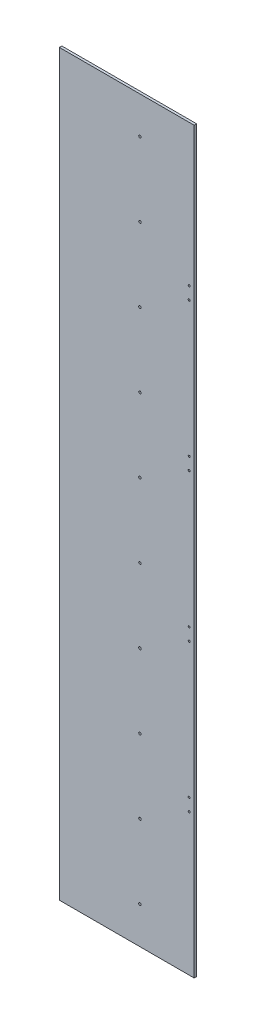
ISO-10303-21;
HEADER;
FILE_DESCRIPTION(('STEP AP214'),'2;1');
FILE_NAME('part.step','',(''),(''),'','','');
FILE_SCHEMA(('AUTOMOTIVE_DESIGN { 1 0 10303 214 1 1 1 1 }'));
ENDSEC;
DATA;
#1=APPLICATION_CONTEXT('core data for automotive mechanical design processes');
#2=APPLICATION_PROTOCOL_DEFINITION('international standard','automotive_design',2000,#1);
#3=PRODUCT_CONTEXT('',#1,'mechanical');
#4=PRODUCT('Part','Part','',(#3));
#5=PRODUCT_RELATED_PRODUCT_CATEGORY('part','',(#4));
#6=PRODUCT_DEFINITION_FORMATION('','',#4);
#7=PRODUCT_DEFINITION_CONTEXT('part definition',#1,'design');
#8=PRODUCT_DEFINITION('design','',#6,#7);
#9=PRODUCT_DEFINITION_SHAPE('','',#8);
#10=(LENGTH_UNIT() NAMED_UNIT(*) SI_UNIT(.MILLI.,.METRE.));
#11=(NAMED_UNIT(*) PLANE_ANGLE_UNIT() SI_UNIT($,.RADIAN.));
#12=(NAMED_UNIT(*) SI_UNIT($,.STERADIAN.) SOLID_ANGLE_UNIT());
#13=UNCERTAINTY_MEASURE_WITH_UNIT(LENGTH_MEASURE(1.E-05),#10,'distance_accuracy_value','');
#14=(GEOMETRIC_REPRESENTATION_CONTEXT(3) GLOBAL_UNCERTAINTY_ASSIGNED_CONTEXT((#13)) GLOBAL_UNIT_ASSIGNED_CONTEXT((#10,
#11,#12)) REPRESENTATION_CONTEXT('',''));
#15=CARTESIAN_POINT('',(0.,0.,0.));
#16=DIRECTION('',(0.,0.,1.));
#17=DIRECTION('',(1.,0.,0.));
#18=AXIS2_PLACEMENT_3D('',#15,#16,#17);
#19=CARTESIAN_POINT('',(75.,0.,-35.));
#20=DIRECTION('',(0.,1.,0.));
#21=DIRECTION('',(-1.,0.,0.));
#22=AXIS2_PLACEMENT_3D('',#19,#20,#21);
#23=PLANE('',#22);
#24=DIRECTION('',(-1.,0.,0.));
#25=VECTOR('',#24,1.);
#26=CARTESIAN_POINT('',(75.,0.,-35.));
#27=LINE('',#26,#25);
#28=CARTESIAN_POINT('',(136.780972450962,0.,-35.));
#29=VERTEX_POINT('',#28);
#30=CARTESIAN_POINT('',(-136.780972450962,0.,-35.));
#31=VERTEX_POINT('',#30);
#32=EDGE_CURVE('E58',#29,#31,#27,.T.);
#33=ORIENTED_EDGE('',*,*,#32,.F.);
#34=DIRECTION('',(0.,0.,-1.));
#35=VECTOR('',#34,1.);
#36=CARTESIAN_POINT('',(136.780972450962,0.,-35.));
#37=LINE('',#36,#35);
#38=CARTESIAN_POINT('',(136.780972450962,0.,-30.));
#39=VERTEX_POINT('',#38);
#40=EDGE_CURVE('E96',#39,#29,#37,.T.);
#41=ORIENTED_EDGE('',*,*,#40,.F.);
#42=DIRECTION('',(1.,0.,0.));
#43=VECTOR('',#42,1.);
#44=CARTESIAN_POINT('',(75.,0.,-30.));
#45=LINE('',#44,#43);
#46=CARTESIAN_POINT('',(-136.780972450962,0.,-30.));
#47=VERTEX_POINT('',#46);
#48=EDGE_CURVE('E67',#39,#47,#45,.F.);
#49=ORIENTED_EDGE('',*,*,#48,.T.);
#50=DIRECTION('',(0.,0.,-1.));
#51=VECTOR('',#50,1.);
#52=CARTESIAN_POINT('',(-136.780972450962,0.,-35.));
#53=LINE('',#52,#51);
#54=EDGE_CURVE('E94',#47,#31,#53,.T.);
#55=ORIENTED_EDGE('',*,*,#54,.T.);
#56=EDGE_LOOP('',(#33,#41,#49,#55));
#57=FACE_BOUND('',#56,.T.);
#58=ADVANCED_FACE('F47',(#57),#23,.F.);
#59=CARTESIAN_POINT('',(75.,1500.,-35.));
#60=DIRECTION('',(0.,1.,0.));
#61=DIRECTION('',(-1.,0.,0.));
#62=AXIS2_PLACEMENT_3D('',#59,#60,#61);
#63=PLANE('',#62);
#64=DIRECTION('',(-1.,0.,0.));
#65=VECTOR('',#64,1.);
#66=CARTESIAN_POINT('',(75.,1500.,-35.));
#67=LINE('',#66,#65);
#68=CARTESIAN_POINT('',(136.780972450962,1500.,-35.));
#69=VERTEX_POINT('',#68);
#70=CARTESIAN_POINT('',(-136.780972450962,1500.,-35.));
#71=VERTEX_POINT('',#70);
#72=EDGE_CURVE('E12',#69,#71,#67,.T.);
#73=ORIENTED_EDGE('',*,*,#72,.T.);
#74=DIRECTION('',(0.,0.,-1.));
#75=VECTOR('',#74,1.);
#76=CARTESIAN_POINT('',(-136.780972450962,1500.,-35.));
#77=LINE('',#76,#75);
#78=CARTESIAN_POINT('',(-136.780972450962,1500.,-30.));
#79=VERTEX_POINT('',#78);
#80=EDGE_CURVE('E118',#79,#71,#77,.T.);
#81=ORIENTED_EDGE('',*,*,#80,.F.);
#82=DIRECTION('',(1.,0.,0.));
#83=VECTOR('',#82,1.);
#84=CARTESIAN_POINT('',(75.,1500.,-30.));
#85=LINE('',#84,#83);
#86=CARTESIAN_POINT('',(136.780972450962,1500.,-30.));
#87=VERTEX_POINT('',#86);
#88=EDGE_CURVE('E86',#87,#79,#85,.F.);
#89=ORIENTED_EDGE('',*,*,#88,.F.);
#90=DIRECTION('',(0.,0.,-1.));
#91=VECTOR('',#90,1.);
#92=CARTESIAN_POINT('',(136.780972450962,1500.,-35.));
#93=LINE('',#92,#91);
#94=EDGE_CURVE('E154',#87,#69,#93,.T.);
#95=ORIENTED_EDGE('',*,*,#94,.T.);
#96=EDGE_LOOP('',(#73,#81,#89,#95));
#97=FACE_BOUND('',#96,.T.);
#98=ADVANCED_FACE('F292',(#97),#63,.T.);
#99=CARTESIAN_POINT('',(26.7499999999954,75.0000000000002,-35.));
#100=DIRECTION('',(0.,0.,1.));
#101=DIRECTION('',(1.,0.,0.));
#102=AXIS2_PLACEMENT_3D('',#99,#100,#101);
#103=CYLINDRICAL_SURFACE('',#102,2.5);
#104=CARTESIAN_POINT('',(26.7499999999954,75.0000000000002,-35.));
#105=DIRECTION('',(0.,0.,-1.));
#106=DIRECTION('',(-1.,0.,0.));
#107=AXIS2_PLACEMENT_3D('',#104,#105,#106);
#108=CIRCLE('',#107,2.5);
#109=CARTESIAN_POINT('',(24.2499999999954,75.0000000000002,-35.));
#110=VERTEX_POINT('',#109);
#111=EDGE_CURVE('E195',#110,#110,#108,.T.);
#112=ORIENTED_EDGE('',*,*,#111,.T.);
#113=EDGE_LOOP('',(#112));
#114=FACE_BOUND('',#113,.T.);
#115=CARTESIAN_POINT('',(26.7499999999954,75.0000000000002,-30.));
#116=DIRECTION('',(0.,0.,-1.));
#117=DIRECTION('',(-1.,0.,0.));
#118=AXIS2_PLACEMENT_3D('',#115,#116,#117);
#119=CIRCLE('',#118,2.5);
#120=CARTESIAN_POINT('',(24.2499999999954,75.0000000000002,-30.));
#121=VERTEX_POINT('',#120);
#122=EDGE_CURVE('E125',#121,#121,#119,.T.);
#123=ORIENTED_EDGE('',*,*,#122,.F.);
#124=EDGE_LOOP('',(#123));
#125=FACE_BOUND('',#124,.T.);
#126=ADVANCED_FACE('F297',(#114,#125),#103,.F.);
#127=CARTESIAN_POINT('',(26.7499999999959,225.,-35.));
#128=DIRECTION('',(0.,0.,1.));
#129=DIRECTION('',(1.,0.,0.));
#130=AXIS2_PLACEMENT_3D('',#127,#128,#129);
#131=CYLINDRICAL_SURFACE('',#130,2.5);
#132=CARTESIAN_POINT('',(26.7499999999959,225.,-35.));
#133=DIRECTION('',(0.,0.,-1.));
#134=DIRECTION('',(-1.,0.,0.));
#135=AXIS2_PLACEMENT_3D('',#132,#133,#134);
#136=CIRCLE('',#135,2.5);
#137=CARTESIAN_POINT('',(24.2499999999959,225.,-35.));
#138=VERTEX_POINT('',#137);
#139=EDGE_CURVE('E199',#138,#138,#136,.T.);
#140=ORIENTED_EDGE('',*,*,#139,.T.);
#141=EDGE_LOOP('',(#140));
#142=FACE_BOUND('',#141,.T.);
#143=CARTESIAN_POINT('',(26.7499999999959,225.,-30.));
#144=DIRECTION('',(0.,0.,-1.));
#145=DIRECTION('',(-1.,0.,0.));
#146=AXIS2_PLACEMENT_3D('',#143,#144,#145);
#147=CIRCLE('',#146,2.5);
#148=CARTESIAN_POINT('',(24.2499999999959,225.,-30.));
#149=VERTEX_POINT('',#148);
#150=EDGE_CURVE('E242',#149,#149,#147,.T.);
#151=ORIENTED_EDGE('',*,*,#150,.F.);
#152=EDGE_LOOP('',(#151));
#153=FACE_BOUND('',#152,.T.);
#154=ADVANCED_FACE('F303',(#142,#153),#131,.F.);
#155=CARTESIAN_POINT('',(26.7499999999964,375.,-35.));
#156=DIRECTION('',(0.,0.,1.));
#157=DIRECTION('',(1.,0.,0.));
#158=AXIS2_PLACEMENT_3D('',#155,#156,#157);
#159=CYLINDRICAL_SURFACE('',#158,2.5);
#160=CARTESIAN_POINT('',(26.7499999999964,375.,-35.));
#161=DIRECTION('',(0.,0.,-1.));
#162=DIRECTION('',(-1.,0.,0.));
#163=AXIS2_PLACEMENT_3D('',#160,#161,#162);
#164=CIRCLE('',#163,2.5);
#165=CARTESIAN_POINT('',(24.2499999999964,375.,-35.));
#166=VERTEX_POINT('',#165);
#167=EDGE_CURVE('E203',#166,#166,#164,.T.);
#168=ORIENTED_EDGE('',*,*,#167,.T.);
#169=EDGE_LOOP('',(#168));
#170=FACE_BOUND('',#169,.T.);
#171=CARTESIAN_POINT('',(26.7499999999964,375.,-30.));
#172=DIRECTION('',(0.,0.,-1.));
#173=DIRECTION('',(-1.,0.,0.));
#174=AXIS2_PLACEMENT_3D('',#171,#172,#173);
#175=CIRCLE('',#174,2.5);
#176=CARTESIAN_POINT('',(24.2499999999964,375.,-30.));
#177=VERTEX_POINT('',#176);
#178=EDGE_CURVE('E246',#177,#177,#175,.T.);
#179=ORIENTED_EDGE('',*,*,#178,.F.);
#180=EDGE_LOOP('',(#179));
#181=FACE_BOUND('',#180,.T.);
#182=ADVANCED_FACE('F307',(#170,#181),#159,.F.);
#183=CARTESIAN_POINT('',(26.7499999999969,525.,-35.));
#184=DIRECTION('',(0.,0.,1.));
#185=DIRECTION('',(1.,0.,0.));
#186=AXIS2_PLACEMENT_3D('',#183,#184,#185);
#187=CYLINDRICAL_SURFACE('',#186,2.5);
#188=CARTESIAN_POINT('',(26.7499999999969,525.,-35.));
#189=DIRECTION('',(0.,0.,-1.));
#190=DIRECTION('',(-1.,0.,0.));
#191=AXIS2_PLACEMENT_3D('',#188,#189,#190);
#192=CIRCLE('',#191,2.5);
#193=CARTESIAN_POINT('',(24.2499999999969,525.,-35.));
#194=VERTEX_POINT('',#193);
#195=EDGE_CURVE('E207',#194,#194,#192,.T.);
#196=ORIENTED_EDGE('',*,*,#195,.T.);
#197=EDGE_LOOP('',(#196));
#198=FACE_BOUND('',#197,.T.);
#199=CARTESIAN_POINT('',(26.7499999999969,525.,-30.));
#200=DIRECTION('',(0.,0.,-1.));
#201=DIRECTION('',(-1.,0.,0.));
#202=AXIS2_PLACEMENT_3D('',#199,#200,#201);
#203=CIRCLE('',#202,2.5);
#204=CARTESIAN_POINT('',(24.2499999999969,525.,-30.));
#205=VERTEX_POINT('',#204);
#206=EDGE_CURVE('E250',#205,#205,#203,.T.);
#207=ORIENTED_EDGE('',*,*,#206,.F.);
#208=EDGE_LOOP('',(#207));
#209=FACE_BOUND('',#208,.T.);
#210=ADVANCED_FACE('F311',(#198,#209),#187,.F.);
#211=CARTESIAN_POINT('',(26.7499999999974,675.,-35.));
#212=DIRECTION('',(0.,0.,1.));
#213=DIRECTION('',(1.,0.,0.));
#214=AXIS2_PLACEMENT_3D('',#211,#212,#213);
#215=CYLINDRICAL_SURFACE('',#214,2.5);
#216=CARTESIAN_POINT('',(26.7499999999974,675.,-35.));
#217=DIRECTION('',(0.,0.,-1.));
#218=DIRECTION('',(-1.,0.,0.));
#219=AXIS2_PLACEMENT_3D('',#216,#217,#218);
#220=CIRCLE('',#219,2.5);
#221=CARTESIAN_POINT('',(24.2499999999974,675.,-35.));
#222=VERTEX_POINT('',#221);
#223=EDGE_CURVE('E211',#222,#222,#220,.T.);
#224=ORIENTED_EDGE('',*,*,#223,.T.);
#225=EDGE_LOOP('',(#224));
#226=FACE_BOUND('',#225,.T.);
#227=CARTESIAN_POINT('',(26.7499999999974,675.,-30.));
#228=DIRECTION('',(0.,0.,-1.));
#229=DIRECTION('',(-1.,0.,0.));
#230=AXIS2_PLACEMENT_3D('',#227,#228,#229);
#231=CIRCLE('',#230,2.5);
#232=CARTESIAN_POINT('',(24.2499999999974,675.,-30.));
#233=VERTEX_POINT('',#232);
#234=EDGE_CURVE('E254',#233,#233,#231,.T.);
#235=ORIENTED_EDGE('',*,*,#234,.F.);
#236=EDGE_LOOP('',(#235));
#237=FACE_BOUND('',#236,.T.);
#238=ADVANCED_FACE('F315',(#226,#237),#215,.F.);
#239=CARTESIAN_POINT('',(26.749999999998,825.,-35.));
#240=DIRECTION('',(0.,0.,1.));
#241=DIRECTION('',(1.,0.,0.));
#242=AXIS2_PLACEMENT_3D('',#239,#240,#241);
#243=CYLINDRICAL_SURFACE('',#242,2.5);
#244=CARTESIAN_POINT('',(26.749999999998,825.,-35.));
#245=DIRECTION('',(0.,0.,-1.));
#246=DIRECTION('',(-1.,0.,0.));
#247=AXIS2_PLACEMENT_3D('',#244,#245,#246);
#248=CIRCLE('',#247,2.5);
#249=CARTESIAN_POINT('',(24.249999999998,825.,-35.));
#250=VERTEX_POINT('',#249);
#251=EDGE_CURVE('E215',#250,#250,#248,.T.);
#252=ORIENTED_EDGE('',*,*,#251,.T.);
#253=EDGE_LOOP('',(#252));
#254=FACE_BOUND('',#253,.T.);
#255=CARTESIAN_POINT('',(26.749999999998,825.,-30.));
#256=DIRECTION('',(0.,0.,-1.));
#257=DIRECTION('',(-1.,0.,0.));
#258=AXIS2_PLACEMENT_3D('',#255,#256,#257);
#259=CIRCLE('',#258,2.5);
#260=CARTESIAN_POINT('',(24.249999999998,825.,-30.));
#261=VERTEX_POINT('',#260);
#262=EDGE_CURVE('E258',#261,#261,#259,.T.);
#263=ORIENTED_EDGE('',*,*,#262,.F.);
#264=EDGE_LOOP('',(#263));
#265=FACE_BOUND('',#264,.T.);
#266=ADVANCED_FACE('F319',(#254,#265),#243,.F.);
#267=CARTESIAN_POINT('',(26.7499999999985,975.,-35.));
#268=DIRECTION('',(0.,0.,1.));
#269=DIRECTION('',(1.,0.,0.));
#270=AXIS2_PLACEMENT_3D('',#267,#268,#269);
#271=CYLINDRICAL_SURFACE('',#270,2.5);
#272=CARTESIAN_POINT('',(26.7499999999985,975.,-35.));
#273=DIRECTION('',(0.,0.,-1.));
#274=DIRECTION('',(-1.,0.,0.));
#275=AXIS2_PLACEMENT_3D('',#272,#273,#274);
#276=CIRCLE('',#275,2.5);
#277=CARTESIAN_POINT('',(24.2499999999985,975.,-35.));
#278=VERTEX_POINT('',#277);
#279=EDGE_CURVE('E219',#278,#278,#276,.T.);
#280=ORIENTED_EDGE('',*,*,#279,.T.);
#281=EDGE_LOOP('',(#280));
#282=FACE_BOUND('',#281,.T.);
#283=CARTESIAN_POINT('',(26.7499999999985,975.,-30.));
#284=DIRECTION('',(0.,0.,-1.));
#285=DIRECTION('',(-1.,0.,0.));
#286=AXIS2_PLACEMENT_3D('',#283,#284,#285);
#287=CIRCLE('',#286,2.5);
#288=CARTESIAN_POINT('',(24.2499999999985,975.,-30.));
#289=VERTEX_POINT('',#288);
#290=EDGE_CURVE('E262',#289,#289,#287,.T.);
#291=ORIENTED_EDGE('',*,*,#290,.F.);
#292=EDGE_LOOP('',(#291));
#293=FACE_BOUND('',#292,.T.);
#294=ADVANCED_FACE('F323',(#282,#293),#271,.F.);
#295=CARTESIAN_POINT('',(26.749999999999,1125.,-35.));
#296=DIRECTION('',(0.,0.,1.));
#297=DIRECTION('',(1.,0.,0.));
#298=AXIS2_PLACEMENT_3D('',#295,#296,#297);
#299=CYLINDRICAL_SURFACE('',#298,2.50000000000011);
#300=CARTESIAN_POINT('',(26.749999999999,1125.,-35.));
#301=DIRECTION('',(0.,0.,-1.));
#302=DIRECTION('',(-1.,0.,0.));
#303=AXIS2_PLACEMENT_3D('',#300,#301,#302);
#304=CIRCLE('',#303,2.50000000000011);
#305=CARTESIAN_POINT('',(24.2499999999989,1125.,-35.));
#306=VERTEX_POINT('',#305);
#307=EDGE_CURVE('E223',#306,#306,#304,.T.);
#308=ORIENTED_EDGE('',*,*,#307,.T.);
#309=EDGE_LOOP('',(#308));
#310=FACE_BOUND('',#309,.T.);
#311=CARTESIAN_POINT('',(26.749999999999,1125.,-30.));
#312=DIRECTION('',(0.,0.,-1.));
#313=DIRECTION('',(-1.,0.,0.));
#314=AXIS2_PLACEMENT_3D('',#311,#312,#313);
#315=CIRCLE('',#314,2.50000000000011);
#316=CARTESIAN_POINT('',(24.2499999999989,1125.,-30.));
#317=VERTEX_POINT('',#316);
#318=EDGE_CURVE('E266',#317,#317,#315,.T.);
#319=ORIENTED_EDGE('',*,*,#318,.F.);
#320=EDGE_LOOP('',(#319));
#321=FACE_BOUND('',#320,.T.);
#322=ADVANCED_FACE('F288',(#310,#321),#299,.F.);
#323=CARTESIAN_POINT('',(26.7499999999995,1275.,-35.));
#324=DIRECTION('',(0.,0.,1.));
#325=DIRECTION('',(1.,0.,0.));
#326=AXIS2_PLACEMENT_3D('',#323,#324,#325);
#327=CYLINDRICAL_SURFACE('',#326,2.50000000000011);
#328=CARTESIAN_POINT('',(26.7499999999995,1275.,-35.));
#329=DIRECTION('',(0.,0.,-1.));
#330=DIRECTION('',(-1.,0.,0.));
#331=AXIS2_PLACEMENT_3D('',#328,#329,#330);
#332=CIRCLE('',#331,2.50000000000011);
#333=CARTESIAN_POINT('',(24.2499999999994,1275.,-35.));
#334=VERTEX_POINT('',#333);
#335=EDGE_CURVE('E227',#334,#334,#332,.T.);
#336=ORIENTED_EDGE('',*,*,#335,.T.);
#337=EDGE_LOOP('',(#336));
#338=FACE_BOUND('',#337,.T.);
#339=CARTESIAN_POINT('',(26.7499999999995,1275.,-30.));
#340=DIRECTION('',(0.,0.,-1.));
#341=DIRECTION('',(-1.,0.,0.));
#342=AXIS2_PLACEMENT_3D('',#339,#340,#341);
#343=CIRCLE('',#342,2.50000000000011);
#344=CARTESIAN_POINT('',(24.2499999999994,1275.,-30.));
#345=VERTEX_POINT('',#344);
#346=EDGE_CURVE('E269',#345,#345,#343,.T.);
#347=ORIENTED_EDGE('',*,*,#346,.F.);
#348=EDGE_LOOP('',(#347));
#349=FACE_BOUND('',#348,.T.);
#350=ADVANCED_FACE('F281',(#338,#349),#327,.F.);
#351=CARTESIAN_POINT('',(26.75,1425.,-35.));
#352=DIRECTION('',(0.,0.,1.));
#353=DIRECTION('',(1.,0.,0.));
#354=AXIS2_PLACEMENT_3D('',#351,#352,#353);
#355=CYLINDRICAL_SURFACE('',#354,2.50000000000012);
#356=CARTESIAN_POINT('',(26.75,1425.,-35.));
#357=DIRECTION('',(0.,0.,-1.));
#358=DIRECTION('',(-1.,0.,0.));
#359=AXIS2_PLACEMENT_3D('',#356,#357,#358);
#360=CIRCLE('',#359,2.50000000000012);
#361=CARTESIAN_POINT('',(24.2499999999999,1425.,-35.));
#362=VERTEX_POINT('',#361);
#363=EDGE_CURVE('E231',#362,#362,#360,.T.);
#364=ORIENTED_EDGE('',*,*,#363,.T.);
#365=EDGE_LOOP('',(#364));
#366=FACE_BOUND('',#365,.T.);
#367=CARTESIAN_POINT('',(26.75,1425.,-30.));
#368=DIRECTION('',(0.,0.,-1.));
#369=DIRECTION('',(-1.,0.,0.));
#370=AXIS2_PLACEMENT_3D('',#367,#368,#369);
#371=CIRCLE('',#370,2.50000000000012);
#372=CARTESIAN_POINT('',(24.2499999999999,1425.,-30.));
#373=VERTEX_POINT('',#372);
#374=EDGE_CURVE('E51',#373,#373,#371,.T.);
#375=ORIENTED_EDGE('',*,*,#374,.F.);
#376=EDGE_LOOP('',(#375));
#377=FACE_BOUND('',#376,.T.);
#378=ADVANCED_FACE('F279',(#366,#377),#355,.F.);
#379=CARTESIAN_POINT('',(75.,1500.,-35.));
#380=DIRECTION('',(0.,0.,1.));
#381=DIRECTION('',(1.,0.,0.));
#382=AXIS2_PLACEMENT_3D('',#379,#380,#381);
#383=PLANE('',#382);
#384=ORIENTED_EDGE('',*,*,#111,.F.);
#385=EDGE_LOOP('',(#384));
#386=FACE_BOUND('',#385,.T.);
#387=ORIENTED_EDGE('',*,*,#139,.F.);
#388=EDGE_LOOP('',(#387));
#389=FACE_BOUND('',#388,.T.);
#390=ORIENTED_EDGE('',*,*,#167,.F.);
#391=EDGE_LOOP('',(#390));
#392=FACE_BOUND('',#391,.T.);
#393=ORIENTED_EDGE('',*,*,#195,.F.);
#394=EDGE_LOOP('',(#393));
#395=FACE_BOUND('',#394,.T.);
#396=ORIENTED_EDGE('',*,*,#223,.F.);
#397=EDGE_LOOP('',(#396));
#398=FACE_BOUND('',#397,.T.);
#399=ORIENTED_EDGE('',*,*,#251,.F.);
#400=EDGE_LOOP('',(#399));
#401=FACE_BOUND('',#400,.T.);
#402=ORIENTED_EDGE('',*,*,#279,.F.);
#403=EDGE_LOOP('',(#402));
#404=FACE_BOUND('',#403,.T.);
#405=ORIENTED_EDGE('',*,*,#307,.F.);
#406=EDGE_LOOP('',(#405));
#407=FACE_BOUND('',#406,.T.);
#408=ORIENTED_EDGE('',*,*,#335,.F.);
#409=EDGE_LOOP('',(#408));
#410=FACE_BOUND('',#409,.T.);
#411=ORIENTED_EDGE('',*,*,#363,.F.);
#412=EDGE_LOOP('',(#411));
#413=FACE_BOUND('',#412,.T.);
#414=ORIENTED_EDGE('',*,*,#32,.T.);
#415=DIRECTION('',(0.,-1.,0.));
#416=VECTOR('',#415,1.);
#417=CARTESIAN_POINT('',(-136.780972450962,1500.,-35.));
#418=LINE('',#417,#416);
#419=EDGE_CURVE('E105',#71,#31,#418,.T.);
#420=ORIENTED_EDGE('',*,*,#419,.F.);
#421=ORIENTED_EDGE('',*,*,#72,.F.);
#422=DIRECTION('',(0.,-1.,0.));
#423=VECTOR('',#422,1.);
#424=CARTESIAN_POINT('',(136.780972450962,1500.,-35.));
#425=LINE('',#424,#423);
#426=EDGE_CURVE('E157',#69,#29,#425,.T.);
#427=ORIENTED_EDGE('',*,*,#426,.T.);
#428=EDGE_LOOP('',(#414,#420,#421,#427));
#429=FACE_BOUND('',#428,.T.);
#430=CARTESIAN_POINT('',(126.780972450962,587.5,-35.));
#431=DIRECTION('',(0.,0.,-1.));
#432=DIRECTION('',(-1.,0.,0.));
#433=AXIS2_PLACEMENT_3D('',#430,#431,#432);
#434=CIRCLE('',#433,1.99999999999999);
#435=CARTESIAN_POINT('',(124.780972450962,587.5,-35.));
#436=VERTEX_POINT('',#435);
#437=EDGE_CURVE('E161',#436,#436,#434,.T.);
#438=ORIENTED_EDGE('',*,*,#437,.F.);
#439=EDGE_LOOP('',(#438));
#440=FACE_BOUND('',#439,.T.);
#441=CARTESIAN_POINT('',(126.780972450962,287.5,-35.));
#442=DIRECTION('',(0.,0.,-1.));
#443=DIRECTION('',(-1.,0.,0.));
#444=AXIS2_PLACEMENT_3D('',#441,#442,#443);
#445=CIRCLE('',#444,2.00000000000001);
#446=CARTESIAN_POINT('',(124.780972450962,287.5,-35.));
#447=VERTEX_POINT('',#446);
#448=EDGE_CURVE('E165',#447,#447,#445,.T.);
#449=ORIENTED_EDGE('',*,*,#448,.F.);
#450=EDGE_LOOP('',(#449));
#451=FACE_BOUND('',#450,.T.);
#452=CARTESIAN_POINT('',(126.780972450962,612.5,-35.));
#453=DIRECTION('',(0.,0.,-1.));
#454=DIRECTION('',(-1.,0.,0.));
#455=AXIS2_PLACEMENT_3D('',#452,#453,#454);
#456=CIRCLE('',#455,2.00000000000003);
#457=CARTESIAN_POINT('',(124.780972450962,612.5,-35.));
#458=VERTEX_POINT('',#457);
#459=EDGE_CURVE('E169',#458,#458,#456,.T.);
#460=ORIENTED_EDGE('',*,*,#459,.F.);
#461=EDGE_LOOP('',(#460));
#462=FACE_BOUND('',#461,.T.);
#463=CARTESIAN_POINT('',(126.780972450962,1212.5,-35.));
#464=DIRECTION('',(0.,0.,-1.));
#465=DIRECTION('',(1.,0.,0.));
#466=AXIS2_PLACEMENT_3D('',#463,#464,#465);
#467=CIRCLE('',#466,2.00000000000001);
#468=CARTESIAN_POINT('',(128.780972450962,1212.5,-35.));
#469=VERTEX_POINT('',#468);
#470=EDGE_CURVE('E173',#469,#469,#467,.T.);
#471=ORIENTED_EDGE('',*,*,#470,.F.);
#472=EDGE_LOOP('',(#471));
#473=FACE_BOUND('',#472,.T.);
#474=CARTESIAN_POINT('',(126.780972450962,912.5,-35.));
#475=DIRECTION('',(0.,0.,-1.));
#476=DIRECTION('',(1.,0.,0.));
#477=AXIS2_PLACEMENT_3D('',#474,#475,#476);
#478=CIRCLE('',#477,1.99999999999999);
#479=CARTESIAN_POINT('',(128.780972450962,912.5,-35.));
#480=VERTEX_POINT('',#479);
#481=EDGE_CURVE('E177',#480,#480,#478,.T.);
#482=ORIENTED_EDGE('',*,*,#481,.F.);
#483=EDGE_LOOP('',(#482));
#484=FACE_BOUND('',#483,.T.);
#485=CARTESIAN_POINT('',(126.780972450962,887.5,-35.));
#486=DIRECTION('',(0.,0.,-1.));
#487=DIRECTION('',(1.,0.,0.));
#488=AXIS2_PLACEMENT_3D('',#485,#486,#487);
#489=CIRCLE('',#488,2.00000000000003);
#490=CARTESIAN_POINT('',(128.780972450962,887.5,-35.));
#491=VERTEX_POINT('',#490);
#492=EDGE_CURVE('E181',#491,#491,#489,.T.);
#493=ORIENTED_EDGE('',*,*,#492,.F.);
#494=EDGE_LOOP('',(#493));
#495=FACE_BOUND('',#494,.T.);
#496=CARTESIAN_POINT('',(126.780972450962,1187.5,-35.));
#497=DIRECTION('',(0.,0.,-1.));
#498=DIRECTION('',(1.,0.,0.));
#499=AXIS2_PLACEMENT_3D('',#496,#497,#498);
#500=CIRCLE('',#499,2.);
#501=CARTESIAN_POINT('',(128.780972450962,1187.5,-35.));
#502=VERTEX_POINT('',#501);
#503=EDGE_CURVE('E185',#502,#502,#500,.T.);
#504=ORIENTED_EDGE('',*,*,#503,.F.);
#505=EDGE_LOOP('',(#504));
#506=FACE_BOUND('',#505,.T.);
#507=CARTESIAN_POINT('',(126.780972450962,312.5,-35.));
#508=DIRECTION('',(0.,0.,-1.));
#509=DIRECTION('',(-1.,0.,0.));
#510=AXIS2_PLACEMENT_3D('',#507,#508,#509);
#511=CIRCLE('',#510,2.);
#512=CARTESIAN_POINT('',(124.780972450962,312.5,-35.));
#513=VERTEX_POINT('',#512);
#514=EDGE_CURVE('E189',#513,#513,#511,.T.);
#515=ORIENTED_EDGE('',*,*,#514,.F.);
#516=EDGE_LOOP('',(#515));
#517=FACE_BOUND('',#516,.T.);
#518=ADVANCED_FACE('F49',(#386,#389,#392,#395,#398,#401,#404,#407,#410,#413,#429,#440,#451,#462,
#473,#484,#495,#506,#517),#383,.F.);
#519=CARTESIAN_POINT('',(75.,1500.,-30.));
#520=DIRECTION('',(0.,0.,1.));
#521=DIRECTION('',(1.,0.,0.));
#522=AXIS2_PLACEMENT_3D('',#519,#520,#521);
#523=PLANE('',#522);
#524=ORIENTED_EDGE('',*,*,#122,.T.);
#525=EDGE_LOOP('',(#524));
#526=FACE_BOUND('',#525,.T.);
#527=ORIENTED_EDGE('',*,*,#150,.T.);
#528=EDGE_LOOP('',(#527));
#529=FACE_BOUND('',#528,.T.);
#530=ORIENTED_EDGE('',*,*,#178,.T.);
#531=EDGE_LOOP('',(#530));
#532=FACE_BOUND('',#531,.T.);
#533=ORIENTED_EDGE('',*,*,#206,.T.);
#534=EDGE_LOOP('',(#533));
#535=FACE_BOUND('',#534,.T.);
#536=ORIENTED_EDGE('',*,*,#234,.T.);
#537=EDGE_LOOP('',(#536));
#538=FACE_BOUND('',#537,.T.);
#539=ORIENTED_EDGE('',*,*,#262,.T.);
#540=EDGE_LOOP('',(#539));
#541=FACE_BOUND('',#540,.T.);
#542=ORIENTED_EDGE('',*,*,#290,.T.);
#543=EDGE_LOOP('',(#542));
#544=FACE_BOUND('',#543,.T.);
#545=ORIENTED_EDGE('',*,*,#318,.T.);
#546=EDGE_LOOP('',(#545));
#547=FACE_BOUND('',#546,.T.);
#548=ORIENTED_EDGE('',*,*,#346,.T.);
#549=EDGE_LOOP('',(#548));
#550=FACE_BOUND('',#549,.T.);
#551=ORIENTED_EDGE('',*,*,#374,.T.);
#552=EDGE_LOOP('',(#551));
#553=FACE_BOUND('',#552,.T.);
#554=ORIENTED_EDGE('',*,*,#48,.F.);
#555=DIRECTION('',(0.,1.,0.));
#556=VECTOR('',#555,1.);
#557=CARTESIAN_POINT('',(136.780972450962,1500.,-30.));
#558=LINE('',#557,#556);
#559=EDGE_CURVE('E111',#87,#39,#558,.F.);
#560=ORIENTED_EDGE('',*,*,#559,.F.);
#561=ORIENTED_EDGE('',*,*,#88,.T.);
#562=DIRECTION('',(0.,1.,0.));
#563=VECTOR('',#562,1.);
#564=CARTESIAN_POINT('',(-136.780972450962,1500.,-30.));
#565=LINE('',#564,#563);
#566=EDGE_CURVE('E103',#79,#47,#565,.F.);
#567=ORIENTED_EDGE('',*,*,#566,.T.);
#568=EDGE_LOOP('',(#554,#560,#561,#567));
#569=FACE_BOUND('',#568,.T.);
#570=CARTESIAN_POINT('',(126.780972450962,587.5,-30.));
#571=DIRECTION('',(0.,0.,-1.));
#572=DIRECTION('',(-1.,0.,0.));
#573=AXIS2_PLACEMENT_3D('',#570,#571,#572);
#574=CIRCLE('',#573,1.99999999999999);
#575=CARTESIAN_POINT('',(124.780972450962,587.5,-30.));
#576=VERTEX_POINT('',#575);
#577=EDGE_CURVE('E150',#576,#576,#574,.T.);
#578=ORIENTED_EDGE('',*,*,#577,.T.);
#579=EDGE_LOOP('',(#578));
#580=FACE_BOUND('',#579,.T.);
#581=CARTESIAN_POINT('',(126.780972450962,287.5,-30.));
#582=DIRECTION('',(0.,0.,-1.));
#583=DIRECTION('',(-1.,0.,0.));
#584=AXIS2_PLACEMENT_3D('',#581,#582,#583);
#585=CIRCLE('',#584,2.00000000000001);
#586=CARTESIAN_POINT('',(124.780972450962,287.5,-30.));
#587=VERTEX_POINT('',#586);
#588=EDGE_CURVE('E146',#587,#587,#585,.T.);
#589=ORIENTED_EDGE('',*,*,#588,.T.);
#590=EDGE_LOOP('',(#589));
#591=FACE_BOUND('',#590,.T.);
#592=CARTESIAN_POINT('',(126.780972450962,612.5,-30.));
#593=DIRECTION('',(0.,0.,-1.));
#594=DIRECTION('',(-1.,0.,0.));
#595=AXIS2_PLACEMENT_3D('',#592,#593,#594);
#596=CIRCLE('',#595,2.00000000000003);
#597=CARTESIAN_POINT('',(124.780972450962,612.5,-30.));
#598=VERTEX_POINT('',#597);
#599=EDGE_CURVE('E142',#598,#598,#596,.T.);
#600=ORIENTED_EDGE('',*,*,#599,.T.);
#601=EDGE_LOOP('',(#600));
#602=FACE_BOUND('',#601,.T.);
#603=CARTESIAN_POINT('',(126.780972450962,1212.5,-30.));
#604=DIRECTION('',(0.,0.,-1.));
#605=DIRECTION('',(-1.,0.,0.));
#606=AXIS2_PLACEMENT_3D('',#603,#604,#605);
#607=CIRCLE('',#606,2.00000000000001);
#608=CARTESIAN_POINT('',(124.780972450962,1212.5,-30.));
#609=VERTEX_POINT('',#608);
#610=EDGE_CURVE('E138',#609,#609,#607,.T.);
#611=ORIENTED_EDGE('',*,*,#610,.T.);
#612=EDGE_LOOP('',(#611));
#613=FACE_BOUND('',#612,.T.);
#614=CARTESIAN_POINT('',(126.780972450962,912.5,-30.));
#615=DIRECTION('',(0.,0.,-1.));
#616=DIRECTION('',(-1.,0.,0.));
#617=AXIS2_PLACEMENT_3D('',#614,#615,#616);
#618=CIRCLE('',#617,1.99999999999999);
#619=CARTESIAN_POINT('',(124.780972450962,912.5,-30.));
#620=VERTEX_POINT('',#619);
#621=EDGE_CURVE('E134',#620,#620,#618,.T.);
#622=ORIENTED_EDGE('',*,*,#621,.T.);
#623=EDGE_LOOP('',(#622));
#624=FACE_BOUND('',#623,.T.);
#625=CARTESIAN_POINT('',(126.780972450962,887.5,-30.));
#626=DIRECTION('',(0.,0.,-1.));
#627=DIRECTION('',(-1.,0.,0.));
#628=AXIS2_PLACEMENT_3D('',#625,#626,#627);
#629=CIRCLE('',#628,2.00000000000003);
#630=CARTESIAN_POINT('',(124.780972450962,887.5,-30.));
#631=VERTEX_POINT('',#630);
#632=EDGE_CURVE('E130',#631,#631,#629,.T.);
#633=ORIENTED_EDGE('',*,*,#632,.T.);
#634=EDGE_LOOP('',(#633));
#635=FACE_BOUND('',#634,.T.);
#636=CARTESIAN_POINT('',(126.780972450962,1187.5,-30.));
#637=DIRECTION('',(0.,0.,-1.));
#638=DIRECTION('',(-1.,0.,0.));
#639=AXIS2_PLACEMENT_3D('',#636,#637,#638);
#640=CIRCLE('',#639,2.);
#641=CARTESIAN_POINT('',(124.780972450962,1187.5,-30.));
#642=VERTEX_POINT('',#641);
#643=EDGE_CURVE('E126',#642,#642,#640,.T.);
#644=ORIENTED_EDGE('',*,*,#643,.T.);
#645=EDGE_LOOP('',(#644));
#646=FACE_BOUND('',#645,.T.);
#647=CARTESIAN_POINT('',(126.780972450962,312.5,-30.));
#648=DIRECTION('',(0.,0.,-1.));
#649=DIRECTION('',(-1.,0.,0.));
#650=AXIS2_PLACEMENT_3D('',#647,#648,#649);
#651=CIRCLE('',#650,2.);
#652=CARTESIAN_POINT('',(124.780972450962,312.5,-30.));
#653=VERTEX_POINT('',#652);
#654=EDGE_CURVE('E121',#653,#653,#651,.T.);
#655=ORIENTED_EDGE('',*,*,#654,.T.);
#656=EDGE_LOOP('',(#655));
#657=FACE_BOUND('',#656,.T.);
#658=ADVANCED_FACE('F108',(#526,#529,#532,#535,#538,#541,#544,#547,#550,#553,#569,#580,#591,
#602,#613,#624,#635,#646,#657),#523,.T.);
#659=CARTESIAN_POINT('',(136.780972450962,1500.,-35.));
#660=DIRECTION('',(-1.,0.,0.));
#661=DIRECTION('',(0.,-1.,0.));
#662=AXIS2_PLACEMENT_3D('',#659,#660,#661);
#663=PLANE('',#662);
#664=ORIENTED_EDGE('',*,*,#94,.F.);
#665=ORIENTED_EDGE('',*,*,#559,.T.);
#666=ORIENTED_EDGE('',*,*,#40,.T.);
#667=ORIENTED_EDGE('',*,*,#426,.F.);
#668=EDGE_LOOP('',(#664,#665,#666,#667));
#669=FACE_BOUND('',#668,.T.);
#670=ADVANCED_FACE('F337',(#669),#663,.F.);
#671=CARTESIAN_POINT('',(126.780972450962,312.5,-35.));
#672=DIRECTION('',(0.,0.,1.));
#673=DIRECTION('',(1.,0.,0.));
#674=AXIS2_PLACEMENT_3D('',#671,#672,#673);
#675=CYLINDRICAL_SURFACE('',#674,2.);
#676=ORIENTED_EDGE('',*,*,#514,.T.);
#677=EDGE_LOOP('',(#676));
#678=FACE_BOUND('',#677,.T.);
#679=ORIENTED_EDGE('',*,*,#654,.F.);
#680=EDGE_LOOP('',(#679));
#681=FACE_BOUND('',#680,.T.);
#682=ADVANCED_FACE('F342',(#678,#681),#675,.F.);
#683=CARTESIAN_POINT('',(126.780972450962,1187.5,-35.));
#684=DIRECTION('',(0.,0.,1.));
#685=DIRECTION('',(1.,0.,0.));
#686=AXIS2_PLACEMENT_3D('',#683,#684,#685);
#687=CYLINDRICAL_SURFACE('',#686,2.);
#688=ORIENTED_EDGE('',*,*,#503,.T.);
#689=EDGE_LOOP('',(#688));
#690=FACE_BOUND('',#689,.T.);
#691=ORIENTED_EDGE('',*,*,#643,.F.);
#692=EDGE_LOOP('',(#691));
#693=FACE_BOUND('',#692,.T.);
#694=ADVANCED_FACE('F370',(#690,#693),#687,.F.);
#695=CARTESIAN_POINT('',(126.780972450962,887.5,-35.));
#696=DIRECTION('',(0.,0.,1.));
#697=DIRECTION('',(1.,0.,0.));
#698=AXIS2_PLACEMENT_3D('',#695,#696,#697);
#699=CYLINDRICAL_SURFACE('',#698,2.00000000000003);
#700=ORIENTED_EDGE('',*,*,#492,.T.);
#701=EDGE_LOOP('',(#700));
#702=FACE_BOUND('',#701,.T.);
#703=ORIENTED_EDGE('',*,*,#632,.F.);
#704=EDGE_LOOP('',(#703));
#705=FACE_BOUND('',#704,.T.);
#706=ADVANCED_FACE('F366',(#702,#705),#699,.F.);
#707=CARTESIAN_POINT('',(126.780972450962,912.5,-35.));
#708=DIRECTION('',(0.,0.,1.));
#709=DIRECTION('',(1.,0.,0.));
#710=AXIS2_PLACEMENT_3D('',#707,#708,#709);
#711=CYLINDRICAL_SURFACE('',#710,1.99999999999999);
#712=ORIENTED_EDGE('',*,*,#481,.T.);
#713=EDGE_LOOP('',(#712));
#714=FACE_BOUND('',#713,.T.);
#715=ORIENTED_EDGE('',*,*,#621,.F.);
#716=EDGE_LOOP('',(#715));
#717=FACE_BOUND('',#716,.T.);
#718=ADVANCED_FACE('F362',(#714,#717),#711,.F.);
#719=CARTESIAN_POINT('',(126.780972450962,1212.5,-35.));
#720=DIRECTION('',(0.,0.,1.));
#721=DIRECTION('',(1.,0.,0.));
#722=AXIS2_PLACEMENT_3D('',#719,#720,#721);
#723=CYLINDRICAL_SURFACE('',#722,2.00000000000001);
#724=ORIENTED_EDGE('',*,*,#470,.T.);
#725=EDGE_LOOP('',(#724));
#726=FACE_BOUND('',#725,.T.);
#727=ORIENTED_EDGE('',*,*,#610,.F.);
#728=EDGE_LOOP('',(#727));
#729=FACE_BOUND('',#728,.T.);
#730=ADVANCED_FACE('F358',(#726,#729),#723,.F.);
#731=CARTESIAN_POINT('',(126.780972450962,612.5,-35.));
#732=DIRECTION('',(0.,0.,1.));
#733=DIRECTION('',(1.,0.,0.));
#734=AXIS2_PLACEMENT_3D('',#731,#732,#733);
#735=CYLINDRICAL_SURFACE('',#734,2.00000000000003);
#736=ORIENTED_EDGE('',*,*,#459,.T.);
#737=EDGE_LOOP('',(#736));
#738=FACE_BOUND('',#737,.T.);
#739=ORIENTED_EDGE('',*,*,#599,.F.);
#740=EDGE_LOOP('',(#739));
#741=FACE_BOUND('',#740,.T.);
#742=ADVANCED_FACE('F354',(#738,#741),#735,.F.);
#743=CARTESIAN_POINT('',(126.780972450962,287.5,-35.));
#744=DIRECTION('',(0.,0.,1.));
#745=DIRECTION('',(1.,0.,0.));
#746=AXIS2_PLACEMENT_3D('',#743,#744,#745);
#747=CYLINDRICAL_SURFACE('',#746,2.00000000000001);
#748=ORIENTED_EDGE('',*,*,#448,.T.);
#749=EDGE_LOOP('',(#748));
#750=FACE_BOUND('',#749,.T.);
#751=ORIENTED_EDGE('',*,*,#588,.F.);
#752=EDGE_LOOP('',(#751));
#753=FACE_BOUND('',#752,.T.);
#754=ADVANCED_FACE('F350',(#750,#753),#747,.F.);
#755=CARTESIAN_POINT('',(126.780972450962,587.5,-35.));
#756=DIRECTION('',(0.,0.,1.));
#757=DIRECTION('',(1.,0.,0.));
#758=AXIS2_PLACEMENT_3D('',#755,#756,#757);
#759=CYLINDRICAL_SURFACE('',#758,1.99999999999999);
#760=ORIENTED_EDGE('',*,*,#437,.T.);
#761=EDGE_LOOP('',(#760));
#762=FACE_BOUND('',#761,.T.);
#763=ORIENTED_EDGE('',*,*,#577,.F.);
#764=EDGE_LOOP('',(#763));
#765=FACE_BOUND('',#764,.T.);
#766=ADVANCED_FACE('F347',(#762,#765),#759,.F.);
#767=CARTESIAN_POINT('',(-136.780972450962,1500.,-35.));
#768=DIRECTION('',(-1.,0.,0.));
#769=DIRECTION('',(0.,-1.,0.));
#770=AXIS2_PLACEMENT_3D('',#767,#768,#769);
#771=PLANE('',#770);
#772=ORIENTED_EDGE('',*,*,#54,.F.);
#773=ORIENTED_EDGE('',*,*,#566,.F.);
#774=ORIENTED_EDGE('',*,*,#80,.T.);
#775=ORIENTED_EDGE('',*,*,#419,.T.);
#776=EDGE_LOOP('',(#772,#773,#774,#775));
#777=FACE_BOUND('',#776,.T.);
#778=ADVANCED_FACE('F102',(#777),#771,.T.);
#779=CLOSED_SHELL('',(#58,#98,#126,#154,#182,#210,#238,#266,#294,#322,#350,#378,#518,#658,#670,
#682,#694,#706,#718,#730,#742,#754,#766,#778));
#780=MANIFOLD_SOLID_BREP('B2',#779);
#781=ADVANCED_BREP_SHAPE_REPRESENTATION('',(#18,#780),#14);
#782=SHAPE_DEFINITION_REPRESENTATION(#9,#781);
ENDSEC;
END-ISO-10303-21;
